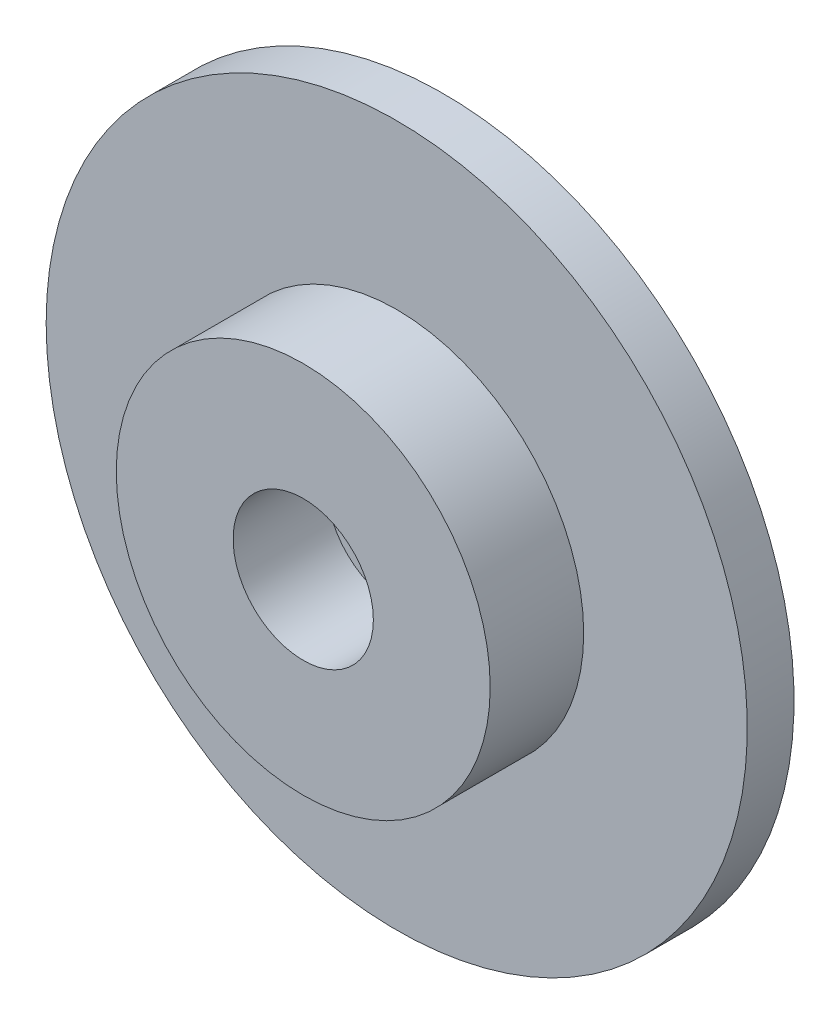
ISO-10303-21;
HEADER;
FILE_DESCRIPTION(('STEP AP214'),'2;1');
FILE_NAME('part.step','',(''),(''),'','','');
FILE_SCHEMA(('AUTOMOTIVE_DESIGN { 1 0 10303 214 1 1 1 1 }'));
ENDSEC;
DATA;
#1=APPLICATION_CONTEXT('core data for automotive mechanical design processes');
#2=APPLICATION_PROTOCOL_DEFINITION('international standard','automotive_design',2000,#1);
#3=PRODUCT_CONTEXT('',#1,'mechanical');
#4=PRODUCT('Part','Part','',(#3));
#5=PRODUCT_RELATED_PRODUCT_CATEGORY('part','',(#4));
#6=PRODUCT_DEFINITION_FORMATION('','',#4);
#7=PRODUCT_DEFINITION_CONTEXT('part definition',#1,'design');
#8=PRODUCT_DEFINITION('design','',#6,#7);
#9=PRODUCT_DEFINITION_SHAPE('','',#8);
#10=(LENGTH_UNIT() NAMED_UNIT(*) SI_UNIT(.MILLI.,.METRE.));
#11=(NAMED_UNIT(*) PLANE_ANGLE_UNIT() SI_UNIT($,.RADIAN.));
#12=(NAMED_UNIT(*) SI_UNIT($,.STERADIAN.) SOLID_ANGLE_UNIT());
#13=UNCERTAINTY_MEASURE_WITH_UNIT(LENGTH_MEASURE(1.E-05),#10,'distance_accuracy_value','');
#14=(GEOMETRIC_REPRESENTATION_CONTEXT(3) GLOBAL_UNCERTAINTY_ASSIGNED_CONTEXT((#13)) GLOBAL_UNIT_ASSIGNED_CONTEXT((#10,
#11,#12)) REPRESENTATION_CONTEXT('',''));
#15=CARTESIAN_POINT('',(0.,0.,0.));
#16=DIRECTION('',(0.,0.,1.));
#17=DIRECTION('',(1.,0.,0.));
#18=AXIS2_PLACEMENT_3D('',#15,#16,#17);
#19=CARTESIAN_POINT('',(0.,0.,2.));
#20=DIRECTION('',(0.,0.,-1.));
#21=DIRECTION('',(-1.,0.,0.));
#22=AXIS2_PLACEMENT_3D('',#19,#20,#21);
#23=CYLINDRICAL_SURFACE('',#22,4.);
#24=CARTESIAN_POINT('',(0.,0.,2.));
#25=DIRECTION('',(0.,0.,1.));
#26=DIRECTION('',(1.,0.,0.));
#27=AXIS2_PLACEMENT_3D('',#24,#25,#26);
#28=CIRCLE('',#27,4.);
#29=CARTESIAN_POINT('',(4.,0.,2.));
#30=VERTEX_POINT('',#29);
#31=EDGE_CURVE('E10',#30,#30,#28,.T.);
#32=ORIENTED_EDGE('',*,*,#31,.F.);
#33=EDGE_LOOP('',(#32));
#34=FACE_BOUND('',#33,.T.);
#35=CARTESIAN_POINT('',(0.,0.,0.));
#36=DIRECTION('',(0.,0.,-1.));
#37=DIRECTION('',(-1.,0.,0.));
#38=AXIS2_PLACEMENT_3D('',#35,#36,#37);
#39=CIRCLE('',#38,4.);
#40=CARTESIAN_POINT('',(-4.,0.,0.));
#41=VERTEX_POINT('',#40);
#42=EDGE_CURVE('E45',#41,#41,#39,.T.);
#43=ORIENTED_EDGE('',*,*,#42,.F.);
#44=EDGE_LOOP('',(#43));
#45=FACE_BOUND('',#44,.T.);
#46=ADVANCED_FACE('F31',(#34,#45),#23,.T.);
#47=CARTESIAN_POINT('',(0.,0.,2.));
#48=DIRECTION('',(0.,0.,1.));
#49=DIRECTION('',(1.,0.,0.));
#50=AXIS2_PLACEMENT_3D('',#47,#48,#49);
#51=PLANE('',#50);
#52=CARTESIAN_POINT('',(0.,0.,2.));
#53=DIRECTION('',(0.,0.,1.));
#54=DIRECTION('',(1.,0.,0.));
#55=AXIS2_PLACEMENT_3D('',#52,#53,#54);
#56=CIRCLE('',#55,1.5);
#57=CARTESIAN_POINT('',(1.5,0.,2.));
#58=VERTEX_POINT('',#57);
#59=EDGE_CURVE('E41',#58,#58,#56,.T.);
#60=ORIENTED_EDGE('',*,*,#59,.F.);
#61=EDGE_LOOP('',(#60));
#62=FACE_BOUND('',#61,.T.);
#63=ORIENTED_EDGE('',*,*,#31,.T.);
#64=EDGE_LOOP('',(#63));
#65=FACE_BOUND('',#64,.T.);
#66=ADVANCED_FACE('F71',(#62,#65),#51,.T.);
#67=CARTESIAN_POINT('',(0.,0.,-0.5));
#68=DIRECTION('',(0.,0.,1.));
#69=DIRECTION('',(1.,0.,0.));
#70=AXIS2_PLACEMENT_3D('',#67,#68,#69);
#71=CYLINDRICAL_SURFACE('',#70,1.5);
#72=ORIENTED_EDGE('',*,*,#59,.T.);
#73=EDGE_LOOP('',(#72));
#74=FACE_BOUND('',#73,.T.);
#75=CARTESIAN_POINT('',(0.,0.,0.));
#76=DIRECTION('',(0.,0.,1.));
#77=DIRECTION('',(1.,0.,0.));
#78=AXIS2_PLACEMENT_3D('',#75,#76,#77);
#79=CIRCLE('',#78,1.5);
#80=CARTESIAN_POINT('',(1.5,0.,0.));
#81=VERTEX_POINT('',#80);
#82=EDGE_CURVE('E34',#81,#81,#79,.T.);
#83=ORIENTED_EDGE('',*,*,#82,.F.);
#84=EDGE_LOOP('',(#83));
#85=FACE_BOUND('',#84,.T.);
#86=ADVANCED_FACE('F76',(#74,#85),#71,.F.);
#87=CARTESIAN_POINT('',(0.,0.,0.));
#88=DIRECTION('',(0.,0.,-1.));
#89=DIRECTION('',(-1.,0.,0.));
#90=AXIS2_PLACEMENT_3D('',#87,#88,#89);
#91=PLANE('',#90);
#92=ORIENTED_EDGE('',*,*,#82,.T.);
#93=EDGE_LOOP('',(#92));
#94=FACE_BOUND('',#93,.T.);
#95=ADVANCED_FACE('F66',(#94),#91,.F.);
#96=CARTESIAN_POINT('',(0.,0.,0.));
#97=DIRECTION('',(0.,0.,-1.));
#98=DIRECTION('',(-1.,0.,0.));
#99=AXIS2_PLACEMENT_3D('',#96,#97,#98);
#100=CIRCLE('',#99,7.5);
#101=CARTESIAN_POINT('',(-7.5,0.,0.));
#102=VERTEX_POINT('',#101);
#103=EDGE_CURVE('E49',#102,#102,#100,.T.);
#104=ORIENTED_EDGE('',*,*,#103,.F.);
#105=EDGE_LOOP('',(#104));
#106=FACE_BOUND('',#105,.T.);
#107=ORIENTED_EDGE('',*,*,#42,.T.);
#108=EDGE_LOOP('',(#107));
#109=FACE_BOUND('',#108,.T.);
#110=ADVANCED_FACE('F60',(#106,#109),#91,.F.);
#111=CARTESIAN_POINT('',(0.,0.,-1.));
#112=DIRECTION('',(0.,0.,1.));
#113=DIRECTION('',(1.,0.,0.));
#114=AXIS2_PLACEMENT_3D('',#111,#112,#113);
#115=CYLINDRICAL_SURFACE('',#114,7.5);
#116=CARTESIAN_POINT('',(0.,0.,-1.));
#117=DIRECTION('',(0.,0.,-1.));
#118=DIRECTION('',(-1.,0.,0.));
#119=AXIS2_PLACEMENT_3D('',#116,#117,#118);
#120=CIRCLE('',#119,7.5);
#121=CARTESIAN_POINT('',(-7.5,0.,-1.));
#122=VERTEX_POINT('',#121);
#123=EDGE_CURVE('E48',#122,#122,#120,.T.);
#124=ORIENTED_EDGE('',*,*,#123,.F.);
#125=EDGE_LOOP('',(#124));
#126=FACE_BOUND('',#125,.T.);
#127=ORIENTED_EDGE('',*,*,#103,.T.);
#128=EDGE_LOOP('',(#127));
#129=FACE_BOUND('',#128,.T.);
#130=ADVANCED_FACE('F57',(#126,#129),#115,.T.);
#131=CARTESIAN_POINT('',(0.,0.,-1.));
#132=DIRECTION('',(0.,0.,-1.));
#133=DIRECTION('',(-1.,0.,0.));
#134=AXIS2_PLACEMENT_3D('',#131,#132,#133);
#135=PLANE('',#134);
#136=ORIENTED_EDGE('',*,*,#123,.T.);
#137=EDGE_LOOP('',(#136));
#138=FACE_BOUND('',#137,.T.);
#139=ADVANCED_FACE('F55',(#138),#135,.T.);
#140=CLOSED_SHELL('',(#46,#66,#86,#95,#110,#130,#139));
#141=MANIFOLD_SOLID_BREP('B2',#140);
#142=ADVANCED_BREP_SHAPE_REPRESENTATION('',(#18,#141),#14);
#143=SHAPE_DEFINITION_REPRESENTATION(#9,#142);
ENDSEC;
END-ISO-10303-21;
